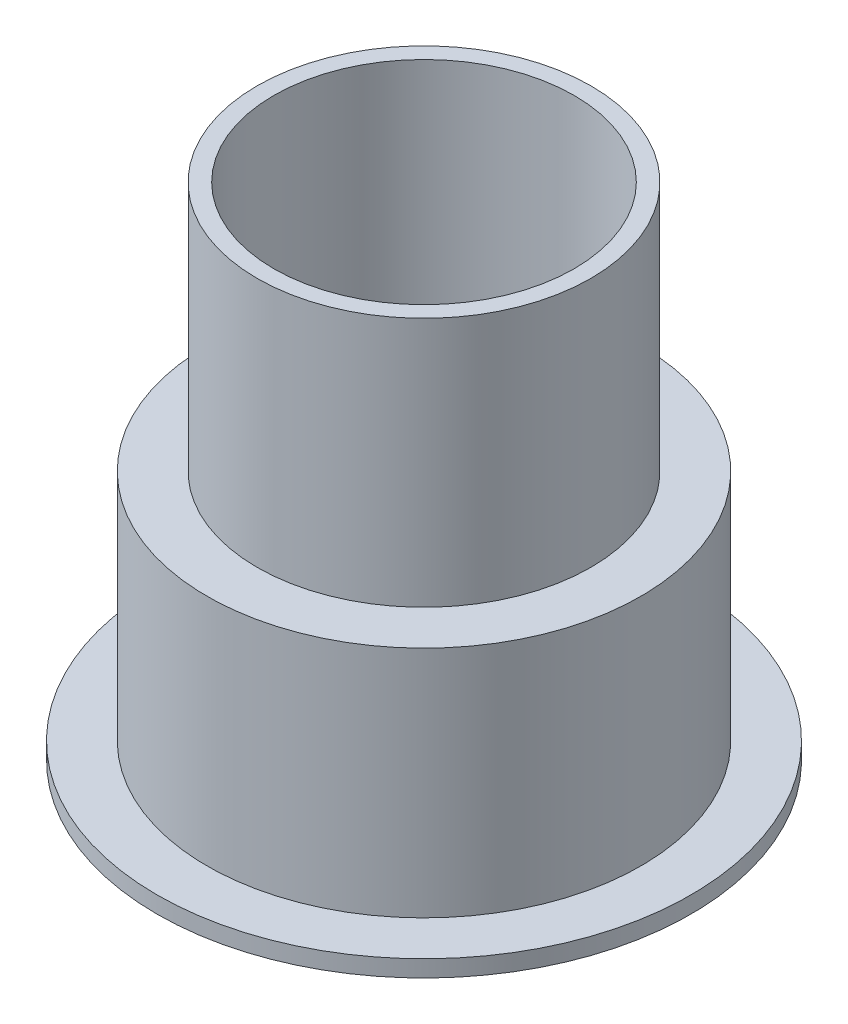
ISO-10303-21;
HEADER;
FILE_DESCRIPTION(('STEP AP214'),'2;1');
FILE_NAME('part.step','',(''),(''),'','','');
FILE_SCHEMA(('AUTOMOTIVE_DESIGN { 1 0 10303 214 1 1 1 1 }'));
ENDSEC;
DATA;
#1=APPLICATION_CONTEXT('core data for automotive mechanical design processes');
#2=APPLICATION_PROTOCOL_DEFINITION('international standard','automotive_design',2000,#1);
#3=PRODUCT_CONTEXT('',#1,'mechanical');
#4=PRODUCT('Part','Part','',(#3));
#5=PRODUCT_RELATED_PRODUCT_CATEGORY('part','',(#4));
#6=PRODUCT_DEFINITION_FORMATION('','',#4);
#7=PRODUCT_DEFINITION_CONTEXT('part definition',#1,'design');
#8=PRODUCT_DEFINITION('design','',#6,#7);
#9=PRODUCT_DEFINITION_SHAPE('','',#8);
#10=(LENGTH_UNIT() NAMED_UNIT(*) SI_UNIT(.MILLI.,.METRE.));
#11=(NAMED_UNIT(*) PLANE_ANGLE_UNIT() SI_UNIT($,.RADIAN.));
#12=(NAMED_UNIT(*) SI_UNIT($,.STERADIAN.) SOLID_ANGLE_UNIT());
#13=UNCERTAINTY_MEASURE_WITH_UNIT(LENGTH_MEASURE(1.E-05),#10,'distance_accuracy_value','');
#14=(GEOMETRIC_REPRESENTATION_CONTEXT(3) GLOBAL_UNCERTAINTY_ASSIGNED_CONTEXT((#13)) GLOBAL_UNIT_ASSIGNED_CONTEXT((#10,
#11,#12)) REPRESENTATION_CONTEXT('',''));
#15=CARTESIAN_POINT('',(0.,0.,0.));
#16=DIRECTION('',(0.,0.,1.));
#17=DIRECTION('',(1.,0.,0.));
#18=AXIS2_PLACEMENT_3D('',#15,#16,#17);
#19=CARTESIAN_POINT('',(6.,-0.854835863287098,0.));
#20=DIRECTION('',(0.,-1.,0.));
#21=DIRECTION('',(0.,0.,-1.));
#22=AXIS2_PLACEMENT_3D('',#19,#20,#21);
#23=PLANE('',#22);
#24=CARTESIAN_POINT('',(0.,-0.854835863287098,0.));
#25=DIRECTION('',(0.,-1.,0.));
#26=DIRECTION('',(0.,0.,-1.));
#27=AXIS2_PLACEMENT_3D('',#24,#25,#26);
#28=CIRCLE('',#27,8.);
#29=CARTESIAN_POINT('',(0.,-0.854835863287098,-8.));
#30=VERTEX_POINT('',#29);
#31=EDGE_CURVE('E10',#30,#30,#28,.T.);
#32=ORIENTED_EDGE('',*,*,#31,.T.);
#33=EDGE_LOOP('',(#32));
#34=FACE_BOUND('',#33,.T.);
#35=CARTESIAN_POINT('',(0.,-0.854835863287098,0.));
#36=DIRECTION('',(0.,-1.,0.));
#37=DIRECTION('',(0.,0.,-1.));
#38=AXIS2_PLACEMENT_3D('',#35,#36,#37);
#39=CIRCLE('',#38,6.);
#40=CARTESIAN_POINT('',(0.,-0.854835863287098,-6.));
#41=VERTEX_POINT('',#40);
#42=EDGE_CURVE('E71',#41,#41,#39,.T.);
#43=ORIENTED_EDGE('',*,*,#42,.F.);
#44=EDGE_LOOP('',(#43));
#45=FACE_BOUND('',#44,.T.);
#46=ADVANCED_FACE('F37',(#34,#45),#23,.T.);
#47=CARTESIAN_POINT('',(0.,0.,0.));
#48=DIRECTION('',(0.,-1.,0.));
#49=DIRECTION('',(0.,0.,-1.));
#50=AXIS2_PLACEMENT_3D('',#47,#48,#49);
#51=CYLINDRICAL_SURFACE('',#50,8.);
#52=CARTESIAN_POINT('',(0.,-0.354835863287098,0.));
#53=DIRECTION('',(0.,-1.,0.));
#54=DIRECTION('',(0.,0.,-1.));
#55=AXIS2_PLACEMENT_3D('',#52,#53,#54);
#56=CIRCLE('',#55,8.);
#57=CARTESIAN_POINT('',(0.,-0.354835863287098,-8.));
#58=VERTEX_POINT('',#57);
#59=EDGE_CURVE('E43',#58,#58,#56,.T.);
#60=ORIENTED_EDGE('',*,*,#59,.T.);
#61=EDGE_LOOP('',(#60));
#62=FACE_BOUND('',#61,.T.);
#63=ORIENTED_EDGE('',*,*,#31,.F.);
#64=EDGE_LOOP('',(#63));
#65=FACE_BOUND('',#64,.T.);
#66=ADVANCED_FACE('F79',(#62,#65),#51,.T.);
#67=CARTESIAN_POINT('',(6.5,-0.354835863287098,0.));
#68=DIRECTION('',(0.,1.,0.));
#69=DIRECTION('',(0.,0.,1.));
#70=AXIS2_PLACEMENT_3D('',#67,#68,#69);
#71=PLANE('',#70);
#72=CARTESIAN_POINT('',(0.,-0.354835863287098,0.));
#73=DIRECTION('',(0.,-1.,0.));
#74=DIRECTION('',(0.,0.,-1.));
#75=AXIS2_PLACEMENT_3D('',#72,#73,#74);
#76=CIRCLE('',#75,6.5);
#77=CARTESIAN_POINT('',(0.,-0.354835863287098,-6.5));
#78=VERTEX_POINT('',#77);
#79=EDGE_CURVE('E47',#78,#78,#76,.T.);
#80=ORIENTED_EDGE('',*,*,#79,.T.);
#81=EDGE_LOOP('',(#80));
#82=FACE_BOUND('',#81,.T.);
#83=ORIENTED_EDGE('',*,*,#59,.F.);
#84=EDGE_LOOP('',(#83));
#85=FACE_BOUND('',#84,.T.);
#86=ADVANCED_FACE('F83',(#82,#85),#71,.T.);
#87=CARTESIAN_POINT('',(0.,0.,0.));
#88=DIRECTION('',(0.,-1.,0.));
#89=DIRECTION('',(0.,0.,-1.));
#90=AXIS2_PLACEMENT_3D('',#87,#88,#89);
#91=CYLINDRICAL_SURFACE('',#90,6.5);
#92=CARTESIAN_POINT('',(0.,6.6451641367129,0.));
#93=DIRECTION('',(0.,-1.,0.));
#94=DIRECTION('',(0.,0.,-1.));
#95=AXIS2_PLACEMENT_3D('',#92,#93,#94);
#96=CIRCLE('',#95,6.5);
#97=CARTESIAN_POINT('',(0.,6.6451641367129,-6.5));
#98=VERTEX_POINT('',#97);
#99=EDGE_CURVE('E51',#98,#98,#96,.T.);
#100=ORIENTED_EDGE('',*,*,#99,.T.);
#101=EDGE_LOOP('',(#100));
#102=FACE_BOUND('',#101,.T.);
#103=ORIENTED_EDGE('',*,*,#79,.F.);
#104=EDGE_LOOP('',(#103));
#105=FACE_BOUND('',#104,.T.);
#106=ADVANCED_FACE('F87',(#102,#105),#91,.T.);
#107=CARTESIAN_POINT('',(6.5,6.6451641367129,0.));
#108=DIRECTION('',(0.,1.,0.));
#109=DIRECTION('',(0.,0.,1.));
#110=AXIS2_PLACEMENT_3D('',#107,#108,#109);
#111=PLANE('',#110);
#112=CARTESIAN_POINT('',(0.,6.6451641367129,0.));
#113=DIRECTION('',(0.,-1.,0.));
#114=DIRECTION('',(0.,0.,-1.));
#115=AXIS2_PLACEMENT_3D('',#112,#113,#114);
#116=CIRCLE('',#115,5.);
#117=CARTESIAN_POINT('',(0.,6.6451641367129,-5.));
#118=VERTEX_POINT('',#117);
#119=EDGE_CURVE('E56',#118,#118,#116,.T.);
#120=ORIENTED_EDGE('',*,*,#119,.T.);
#121=EDGE_LOOP('',(#120));
#122=FACE_BOUND('',#121,.T.);
#123=ORIENTED_EDGE('',*,*,#99,.F.);
#124=EDGE_LOOP('',(#123));
#125=FACE_BOUND('',#124,.T.);
#126=ADVANCED_FACE('F94',(#122,#125),#111,.T.);
#127=CARTESIAN_POINT('',(0.,0.,0.));
#128=DIRECTION('',(0.,-1.,0.));
#129=DIRECTION('',(0.,0.,-1.));
#130=AXIS2_PLACEMENT_3D('',#127,#128,#129);
#131=CYLINDRICAL_SURFACE('',#130,5.);
#132=CARTESIAN_POINT('',(0.,14.1451641367129,0.));
#133=DIRECTION('',(0.,-1.,0.));
#134=DIRECTION('',(0.,0.,-1.));
#135=AXIS2_PLACEMENT_3D('',#132,#133,#134);
#136=CIRCLE('',#135,5.);
#137=CARTESIAN_POINT('',(0.,14.1451641367129,-5.));
#138=VERTEX_POINT('',#137);
#139=EDGE_CURVE('E59',#138,#138,#136,.T.);
#140=ORIENTED_EDGE('',*,*,#139,.T.);
#141=EDGE_LOOP('',(#140));
#142=FACE_BOUND('',#141,.T.);
#143=ORIENTED_EDGE('',*,*,#119,.F.);
#144=EDGE_LOOP('',(#143));
#145=FACE_BOUND('',#144,.T.);
#146=ADVANCED_FACE('F98',(#142,#145),#131,.T.);
#147=CARTESIAN_POINT('',(4.5,14.1451641367129,0.));
#148=DIRECTION('',(0.,1.,0.));
#149=DIRECTION('',(0.,0.,1.));
#150=AXIS2_PLACEMENT_3D('',#147,#148,#149);
#151=PLANE('',#150);
#152=CARTESIAN_POINT('',(0.,14.1451641367129,0.));
#153=DIRECTION('',(0.,-1.,0.));
#154=DIRECTION('',(0.,0.,-1.));
#155=AXIS2_PLACEMENT_3D('',#152,#153,#154);
#156=CIRCLE('',#155,4.5);
#157=CARTESIAN_POINT('',(0.,14.1451641367129,-4.5));
#158=VERTEX_POINT('',#157);
#159=EDGE_CURVE('E62',#158,#158,#156,.T.);
#160=ORIENTED_EDGE('',*,*,#159,.T.);
#161=EDGE_LOOP('',(#160));
#162=FACE_BOUND('',#161,.T.);
#163=ORIENTED_EDGE('',*,*,#139,.F.);
#164=EDGE_LOOP('',(#163));
#165=FACE_BOUND('',#164,.T.);
#166=ADVANCED_FACE('F102',(#162,#165),#151,.T.);
#167=CARTESIAN_POINT('',(0.,0.,0.));
#168=DIRECTION('',(0.,-1.,0.));
#169=DIRECTION('',(0.,0.,-1.));
#170=AXIS2_PLACEMENT_3D('',#167,#168,#169);
#171=CYLINDRICAL_SURFACE('',#170,4.5);
#172=CARTESIAN_POINT('',(0.,6.6451641367129,0.));
#173=DIRECTION('',(0.,-1.,0.));
#174=DIRECTION('',(0.,0.,-1.));
#175=AXIS2_PLACEMENT_3D('',#172,#173,#174);
#176=CIRCLE('',#175,4.5);
#177=CARTESIAN_POINT('',(0.,6.6451641367129,-4.5));
#178=VERTEX_POINT('',#177);
#179=EDGE_CURVE('E65',#178,#178,#176,.T.);
#180=ORIENTED_EDGE('',*,*,#179,.T.);
#181=EDGE_LOOP('',(#180));
#182=FACE_BOUND('',#181,.T.);
#183=ORIENTED_EDGE('',*,*,#159,.F.);
#184=EDGE_LOOP('',(#183));
#185=FACE_BOUND('',#184,.T.);
#186=ADVANCED_FACE('F106',(#182,#185),#171,.F.);
#187=CARTESIAN_POINT('',(4.5,6.6451641367129,0.));
#188=DIRECTION('',(0.,1.,0.));
#189=DIRECTION('',(0.,0.,1.));
#190=AXIS2_PLACEMENT_3D('',#187,#188,#189);
#191=PLANE('',#190);
#192=ORIENTED_EDGE('',*,*,#179,.F.);
#193=EDGE_LOOP('',(#192));
#194=FACE_BOUND('',#193,.T.);
#195=ADVANCED_FACE('F110',(#194),#191,.T.);
#196=CARTESIAN_POINT('',(6.,6.1451641367129,0.));
#197=DIRECTION('',(0.,-1.,0.));
#198=DIRECTION('',(0.,0.,-1.));
#199=AXIS2_PLACEMENT_3D('',#196,#197,#198);
#200=PLANE('',#199);
#201=CARTESIAN_POINT('',(0.,6.1451641367129,0.));
#202=DIRECTION('',(0.,-1.,0.));
#203=DIRECTION('',(0.,0.,-1.));
#204=AXIS2_PLACEMENT_3D('',#201,#202,#203);
#205=CIRCLE('',#204,6.);
#206=CARTESIAN_POINT('',(0.,6.1451641367129,-6.));
#207=VERTEX_POINT('',#206);
#208=EDGE_CURVE('E68',#207,#207,#205,.T.);
#209=ORIENTED_EDGE('',*,*,#208,.T.);
#210=EDGE_LOOP('',(#209));
#211=FACE_BOUND('',#210,.T.);
#212=ADVANCED_FACE('F114',(#211),#200,.T.);
#213=CARTESIAN_POINT('',(0.,0.,0.));
#214=DIRECTION('',(0.,-1.,0.));
#215=DIRECTION('',(0.,0.,-1.));
#216=AXIS2_PLACEMENT_3D('',#213,#214,#215);
#217=CYLINDRICAL_SURFACE('',#216,6.);
#218=ORIENTED_EDGE('',*,*,#42,.T.);
#219=EDGE_LOOP('',(#218));
#220=FACE_BOUND('',#219,.T.);
#221=ORIENTED_EDGE('',*,*,#208,.F.);
#222=EDGE_LOOP('',(#221));
#223=FACE_BOUND('',#222,.T.);
#224=ADVANCED_FACE('F75',(#220,#223),#217,.F.);
#225=CLOSED_SHELL('',(#46,#66,#86,#106,#126,#146,#166,#186,#195,#212,#224));
#226=MANIFOLD_SOLID_BREP('B2',#225);
#227=ADVANCED_BREP_SHAPE_REPRESENTATION('',(#18,#226),#14);
#228=SHAPE_DEFINITION_REPRESENTATION(#9,#227);
ENDSEC;
END-ISO-10303-21;
